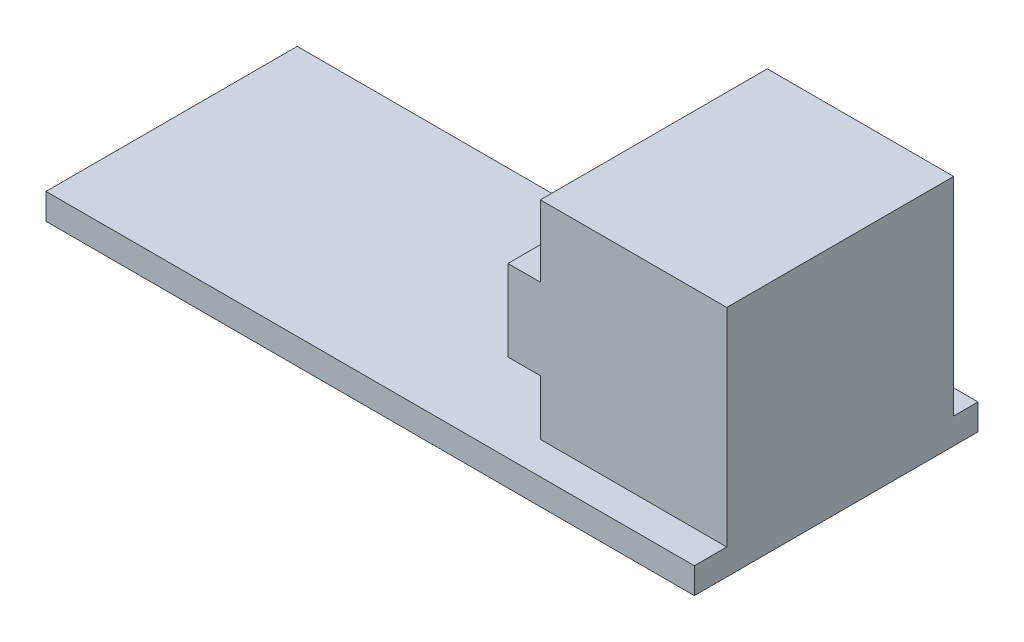
ISO-10303-21;
HEADER;
FILE_DESCRIPTION(('STEP AP214'),'2;1');
FILE_NAME('part.step','',(''),(''),'','','');
FILE_SCHEMA(('AUTOMOTIVE_DESIGN { 1 0 10303 214 1 1 1 1 }'));
ENDSEC;
DATA;
#1=APPLICATION_CONTEXT('core data for automotive mechanical design processes');
#2=APPLICATION_PROTOCOL_DEFINITION('international standard','automotive_design',2000,#1);
#3=PRODUCT_CONTEXT('',#1,'mechanical');
#4=PRODUCT('Part','Part','',(#3));
#5=PRODUCT_RELATED_PRODUCT_CATEGORY('part','',(#4));
#6=PRODUCT_DEFINITION_FORMATION('','',#4);
#7=PRODUCT_DEFINITION_CONTEXT('part definition',#1,'design');
#8=PRODUCT_DEFINITION('design','',#6,#7);
#9=PRODUCT_DEFINITION_SHAPE('','',#8);
#10=(LENGTH_UNIT() NAMED_UNIT(*) SI_UNIT(.MILLI.,.METRE.));
#11=(NAMED_UNIT(*) PLANE_ANGLE_UNIT() SI_UNIT($,.RADIAN.));
#12=(NAMED_UNIT(*) SI_UNIT($,.STERADIAN.) SOLID_ANGLE_UNIT());
#13=UNCERTAINTY_MEASURE_WITH_UNIT(LENGTH_MEASURE(1.E-05),#10,'distance_accuracy_value','');
#14=(GEOMETRIC_REPRESENTATION_CONTEXT(3) GLOBAL_UNCERTAINTY_ASSIGNED_CONTEXT((#13)) GLOBAL_UNIT_ASSIGNED_CONTEXT((#10,
#11,#12)) REPRESENTATION_CONTEXT('',''));
#15=CARTESIAN_POINT('',(0.,0.,0.));
#16=DIRECTION('',(0.,0.,1.));
#17=DIRECTION('',(1.,0.,0.));
#18=AXIS2_PLACEMENT_3D('',#15,#16,#17);
#19=CARTESIAN_POINT('',(0.,1.6,0.));
#20=DIRECTION('',(0.,-1.,0.));
#21=DIRECTION('',(0.,0.,-1.));
#22=AXIS2_PLACEMENT_3D('',#19,#20,#21);
#23=PLANE('',#22);
#24=DIRECTION('',(-1.,0.,0.));
#25=VECTOR('',#24,1.);
#26=CARTESIAN_POINT('',(40.,1.6,-16.));
#27=LINE('',#26,#25);
#28=CARTESIAN_POINT('',(40.,1.6,-16.));
#29=VERTEX_POINT('',#28);
#30=CARTESIAN_POINT('',(28.5,1.6,-16.));
#31=VERTEX_POINT('',#30);
#32=EDGE_CURVE('E54',#29,#31,#27,.T.);
#33=ORIENTED_EDGE('',*,*,#32,.F.);
#34=DIRECTION('',(0.,0.,-1.));
#35=VECTOR('',#34,1.);
#36=CARTESIAN_POINT('',(40.,1.6,-17.5));
#37=LINE('',#36,#35);
#38=CARTESIAN_POINT('',(40.,1.6,-17.5));
#39=VERTEX_POINT('',#38);
#40=EDGE_CURVE('E164',#29,#39,#37,.T.);
#41=ORIENTED_EDGE('',*,*,#40,.T.);
#42=DIRECTION('',(-1.,0.,0.));
#43=VECTOR('',#42,1.);
#44=CARTESIAN_POINT('',(26.,1.6,-17.5));
#45=LINE('',#44,#43);
#46=CARTESIAN_POINT('',(26.,1.6,-17.5));
#47=VERTEX_POINT('',#46);
#48=EDGE_CURVE('E115',#39,#47,#45,.T.);
#49=ORIENTED_EDGE('',*,*,#48,.T.);
#50=DIRECTION('',(0.,0.,1.));
#51=VECTOR('',#50,1.);
#52=CARTESIAN_POINT('',(26.,1.6,-15.5));
#53=LINE('',#52,#51);
#54=CARTESIAN_POINT('',(26.,1.6,-15.5));
#55=VERTEX_POINT('',#54);
#56=EDGE_CURVE('E109',#47,#55,#53,.T.);
#57=ORIENTED_EDGE('',*,*,#56,.T.);
#58=DIRECTION('',(-1.,0.,0.));
#59=VECTOR('',#58,1.);
#60=CARTESIAN_POINT('',(0.,1.6,-15.5));
#61=LINE('',#60,#59);
#62=CARTESIAN_POINT('',(0.,1.6,-15.5));
#63=VERTEX_POINT('',#62);
#64=EDGE_CURVE('E112',#55,#63,#61,.T.);
#65=ORIENTED_EDGE('',*,*,#64,.T.);
#66=DIRECTION('',(0.,0.,1.));
#67=VECTOR('',#66,1.);
#68=CARTESIAN_POINT('',(0.,1.6,0.));
#69=LINE('',#68,#67);
#70=CARTESIAN_POINT('',(0.,1.6,0.));
#71=VERTEX_POINT('',#70);
#72=EDGE_CURVE('E63',#63,#71,#69,.T.);
#73=ORIENTED_EDGE('',*,*,#72,.T.);
#74=DIRECTION('',(1.,0.,0.));
#75=VECTOR('',#74,1.);
#76=CARTESIAN_POINT('',(40.,1.6,0.));
#77=LINE('',#76,#75);
#78=CARTESIAN_POINT('',(40.,1.6,0.));
#79=VERTEX_POINT('',#78);
#80=EDGE_CURVE('E148',#71,#79,#77,.T.);
#81=ORIENTED_EDGE('',*,*,#80,.T.);
#82=CARTESIAN_POINT('',(40.,1.6,-2.));
#83=VERTEX_POINT('',#82);
#84=EDGE_CURVE('E98',#79,#83,#37,.T.);
#85=ORIENTED_EDGE('',*,*,#84,.T.);
#86=DIRECTION('',(-1.,0.,0.));
#87=VECTOR('',#86,1.);
#88=CARTESIAN_POINT('',(40.,1.6,-2.));
#89=LINE('',#88,#87);
#90=CARTESIAN_POINT('',(28.5,1.6,-2.));
#91=VERTEX_POINT('',#90);
#92=EDGE_CURVE('E175',#83,#91,#89,.T.);
#93=ORIENTED_EDGE('',*,*,#92,.T.);
#94=DIRECTION('',(0.,0.,-1.));
#95=VECTOR('',#94,1.);
#96=CARTESIAN_POINT('',(28.5,1.6,-2.));
#97=LINE('',#96,#95);
#98=EDGE_CURVE('E168',#91,#31,#97,.T.);
#99=ORIENTED_EDGE('',*,*,#98,.T.);
#100=EDGE_LOOP('',(#33,#41,#49,#57,#65,#73,#81,#85,#93,#99));
#101=FACE_BOUND('',#100,.T.);
#102=ADVANCED_FACE('F39',(#101),#23,.F.);
#103=CARTESIAN_POINT('',(40.,1.6,0.));
#104=DIRECTION('',(0.,0.,-1.));
#105=DIRECTION('',(-1.,0.,0.));
#106=AXIS2_PLACEMENT_3D('',#103,#104,#105);
#107=PLANE('',#106);
#108=DIRECTION('',(1.,0.,0.));
#109=VECTOR('',#108,1.);
#110=CARTESIAN_POINT('',(40.,0.,0.));
#111=LINE('',#110,#109);
#112=CARTESIAN_POINT('',(0.,0.,0.));
#113=VERTEX_POINT('',#112);
#114=CARTESIAN_POINT('',(40.,0.,0.));
#115=VERTEX_POINT('',#114);
#116=EDGE_CURVE('E136',#113,#115,#111,.T.);
#117=ORIENTED_EDGE('',*,*,#116,.T.);
#118=DIRECTION('',(0.,-1.,0.));
#119=VECTOR('',#118,1.);
#120=CARTESIAN_POINT('',(40.,1.6,0.));
#121=LINE('',#120,#119);
#122=EDGE_CURVE('E11',#79,#115,#121,.T.);
#123=ORIENTED_EDGE('',*,*,#122,.F.);
#124=ORIENTED_EDGE('',*,*,#80,.F.);
#125=DIRECTION('',(0.,-1.,0.));
#126=VECTOR('',#125,1.);
#127=CARTESIAN_POINT('',(0.,1.6,0.));
#128=LINE('',#127,#126);
#129=EDGE_CURVE('E132',#71,#113,#128,.T.);
#130=ORIENTED_EDGE('',*,*,#129,.T.);
#131=EDGE_LOOP('',(#117,#123,#124,#130));
#132=FACE_BOUND('',#131,.T.);
#133=ADVANCED_FACE('F41',(#132),#107,.F.);
#134=CARTESIAN_POINT('',(40.,1.6,-17.5));
#135=DIRECTION('',(-1.,0.,0.));
#136=DIRECTION('',(0.,0.,1.));
#137=AXIS2_PLACEMENT_3D('',#134,#135,#136);
#138=PLANE('',#137);
#139=DIRECTION('',(0.,0.,-1.));
#140=VECTOR('',#139,1.);
#141=CARTESIAN_POINT('',(40.,0.,-17.5));
#142=LINE('',#141,#140);
#143=CARTESIAN_POINT('',(40.,0.,-17.5));
#144=VERTEX_POINT('',#143);
#145=EDGE_CURVE('E139',#115,#144,#142,.T.);
#146=ORIENTED_EDGE('',*,*,#145,.T.);
#147=DIRECTION('',(0.,-1.,0.));
#148=VECTOR('',#147,1.);
#149=CARTESIAN_POINT('',(40.,1.6,-17.5));
#150=LINE('',#149,#148);
#151=EDGE_CURVE('E47',#39,#144,#150,.T.);
#152=ORIENTED_EDGE('',*,*,#151,.F.);
#153=ORIENTED_EDGE('',*,*,#40,.F.);
#154=DIRECTION('',(0.,-1.,0.));
#155=VECTOR('',#154,1.);
#156=CARTESIAN_POINT('',(40.,14.4,-16.));
#157=LINE('',#156,#155);
#158=CARTESIAN_POINT('',(40.,14.4,-16.));
#159=VERTEX_POINT('',#158);
#160=EDGE_CURVE('E261',#159,#29,#157,.T.);
#161=ORIENTED_EDGE('',*,*,#160,.F.);
#162=DIRECTION('',(0.,0.,-1.));
#163=VECTOR('',#162,1.);
#164=CARTESIAN_POINT('',(40.,14.4,-2.));
#165=LINE('',#164,#163);
#166=CARTESIAN_POINT('',(40.,14.4,-2.));
#167=VERTEX_POINT('',#166);
#168=EDGE_CURVE('E140',#167,#159,#165,.T.);
#169=ORIENTED_EDGE('',*,*,#168,.F.);
#170=DIRECTION('',(0.,-1.,0.));
#171=VECTOR('',#170,1.);
#172=CARTESIAN_POINT('',(40.,14.4,-2.));
#173=LINE('',#172,#171);
#174=EDGE_CURVE('E241',#167,#83,#173,.T.);
#175=ORIENTED_EDGE('',*,*,#174,.T.);
#176=ORIENTED_EDGE('',*,*,#84,.F.);
#177=ORIENTED_EDGE('',*,*,#122,.T.);
#178=EDGE_LOOP('',(#146,#152,#153,#161,#169,#175,#176,#177));
#179=FACE_BOUND('',#178,.T.);
#180=ADVANCED_FACE('F281',(#179),#138,.F.);
#181=CARTESIAN_POINT('',(26.,1.6,-17.5));
#182=DIRECTION('',(0.,0.,1.));
#183=DIRECTION('',(1.,0.,0.));
#184=AXIS2_PLACEMENT_3D('',#181,#182,#183);
#185=PLANE('',#184);
#186=DIRECTION('',(-1.,0.,0.));
#187=VECTOR('',#186,1.);
#188=CARTESIAN_POINT('',(26.,0.,-17.5));
#189=LINE('',#188,#187);
#190=CARTESIAN_POINT('',(26.,0.,-17.5));
#191=VERTEX_POINT('',#190);
#192=EDGE_CURVE('E142',#144,#191,#189,.T.);
#193=ORIENTED_EDGE('',*,*,#192,.T.);
#194=DIRECTION('',(0.,-1.,0.));
#195=VECTOR('',#194,1.);
#196=CARTESIAN_POINT('',(26.,1.6,-17.5));
#197=LINE('',#196,#195);
#198=EDGE_CURVE('E127',#47,#191,#197,.T.);
#199=ORIENTED_EDGE('',*,*,#198,.F.);
#200=ORIENTED_EDGE('',*,*,#48,.F.);
#201=ORIENTED_EDGE('',*,*,#151,.T.);
#202=EDGE_LOOP('',(#193,#199,#200,#201));
#203=FACE_BOUND('',#202,.T.);
#204=ADVANCED_FACE('F155',(#203),#185,.F.);
#205=CARTESIAN_POINT('',(26.,1.6,-15.5));
#206=DIRECTION('',(1.,0.,0.));
#207=DIRECTION('',(0.,0.,-1.));
#208=AXIS2_PLACEMENT_3D('',#205,#206,#207);
#209=PLANE('',#208);
#210=DIRECTION('',(0.,0.,1.));
#211=VECTOR('',#210,1.);
#212=CARTESIAN_POINT('',(26.,0.,-15.5));
#213=LINE('',#212,#211);
#214=CARTESIAN_POINT('',(26.,0.,-15.5));
#215=VERTEX_POINT('',#214);
#216=EDGE_CURVE('E124',#191,#215,#213,.T.);
#217=ORIENTED_EDGE('',*,*,#216,.T.);
#218=DIRECTION('',(0.,-1.,0.));
#219=VECTOR('',#218,1.);
#220=CARTESIAN_POINT('',(26.,1.6,-15.5));
#221=LINE('',#220,#219);
#222=EDGE_CURVE('E121',#55,#215,#221,.T.);
#223=ORIENTED_EDGE('',*,*,#222,.F.);
#224=ORIENTED_EDGE('',*,*,#56,.F.);
#225=ORIENTED_EDGE('',*,*,#198,.T.);
#226=EDGE_LOOP('',(#217,#223,#224,#225));
#227=FACE_BOUND('',#226,.T.);
#228=ADVANCED_FACE('F122',(#227),#209,.F.);
#229=CARTESIAN_POINT('',(0.,1.6,-15.5));
#230=DIRECTION('',(0.,0.,1.));
#231=DIRECTION('',(1.,0.,0.));
#232=AXIS2_PLACEMENT_3D('',#229,#230,#231);
#233=PLANE('',#232);
#234=DIRECTION('',(-1.,0.,0.));
#235=VECTOR('',#234,1.);
#236=CARTESIAN_POINT('',(0.,0.,-15.5));
#237=LINE('',#236,#235);
#238=CARTESIAN_POINT('',(0.,0.,-15.5));
#239=VERTEX_POINT('',#238);
#240=EDGE_CURVE('E145',#215,#239,#237,.T.);
#241=ORIENTED_EDGE('',*,*,#240,.T.);
#242=DIRECTION('',(0.,-1.,0.));
#243=VECTOR('',#242,1.);
#244=CARTESIAN_POINT('',(0.,1.6,-15.5));
#245=LINE('',#244,#243);
#246=EDGE_CURVE('E128',#63,#239,#245,.T.);
#247=ORIENTED_EDGE('',*,*,#246,.F.);
#248=ORIENTED_EDGE('',*,*,#64,.F.);
#249=ORIENTED_EDGE('',*,*,#222,.T.);
#250=EDGE_LOOP('',(#241,#247,#248,#249));
#251=FACE_BOUND('',#250,.T.);
#252=ADVANCED_FACE('F130',(#251),#233,.F.);
#253=CARTESIAN_POINT('',(0.,1.6,0.));
#254=DIRECTION('',(1.,0.,0.));
#255=DIRECTION('',(0.,0.,-1.));
#256=AXIS2_PLACEMENT_3D('',#253,#254,#255);
#257=PLANE('',#256);
#258=DIRECTION('',(0.,0.,1.));
#259=VECTOR('',#258,1.);
#260=CARTESIAN_POINT('',(0.,0.,0.));
#261=LINE('',#260,#259);
#262=EDGE_CURVE('E90',#239,#113,#261,.T.);
#263=ORIENTED_EDGE('',*,*,#262,.T.);
#264=ORIENTED_EDGE('',*,*,#129,.F.);
#265=ORIENTED_EDGE('',*,*,#72,.F.);
#266=ORIENTED_EDGE('',*,*,#246,.T.);
#267=EDGE_LOOP('',(#263,#264,#265,#266));
#268=FACE_BOUND('',#267,.T.);
#269=ADVANCED_FACE('F160',(#268),#257,.F.);
#270=CARTESIAN_POINT('',(0.,0.,0.));
#271=DIRECTION('',(0.,-1.,0.));
#272=DIRECTION('',(0.,0.,-1.));
#273=AXIS2_PLACEMENT_3D('',#270,#271,#272);
#274=PLANE('',#273);
#275=ORIENTED_EDGE('',*,*,#116,.F.);
#276=ORIENTED_EDGE('',*,*,#262,.F.);
#277=ORIENTED_EDGE('',*,*,#240,.F.);
#278=ORIENTED_EDGE('',*,*,#216,.F.);
#279=ORIENTED_EDGE('',*,*,#192,.F.);
#280=ORIENTED_EDGE('',*,*,#145,.F.);
#281=EDGE_LOOP('',(#275,#276,#277,#278,#279,#280));
#282=FACE_BOUND('',#281,.T.);
#283=ADVANCED_FACE('F159',(#282),#274,.T.);
#284=CARTESIAN_POINT('',(28.5,14.4,-2.));
#285=DIRECTION('',(0.,1.,0.));
#286=DIRECTION('',(-1.,0.,0.));
#287=AXIS2_PLACEMENT_3D('',#284,#285,#286);
#288=PLANE('',#287);
#289=DIRECTION('',(1.,0.,0.));
#290=VECTOR('',#289,1.);
#291=CARTESIAN_POINT('',(28.5,14.4,-16.));
#292=LINE('',#291,#290);
#293=CARTESIAN_POINT('',(28.5,14.4,-16.));
#294=VERTEX_POINT('',#293);
#295=EDGE_CURVE('E234',#294,#159,#292,.T.);
#296=ORIENTED_EDGE('',*,*,#295,.F.);
#297=DIRECTION('',(0.,0.,-1.));
#298=VECTOR('',#297,1.);
#299=CARTESIAN_POINT('',(28.5,14.4,-2.));
#300=LINE('',#299,#298);
#301=CARTESIAN_POINT('',(28.5,14.4,-2.));
#302=VERTEX_POINT('',#301);
#303=EDGE_CURVE('E219',#302,#294,#300,.T.);
#304=ORIENTED_EDGE('',*,*,#303,.F.);
#305=DIRECTION('',(1.,0.,0.));
#306=VECTOR('',#305,1.);
#307=CARTESIAN_POINT('',(28.5,14.4,-2.));
#308=LINE('',#307,#306);
#309=EDGE_CURVE('E255',#302,#167,#308,.T.);
#310=ORIENTED_EDGE('',*,*,#309,.T.);
#311=ORIENTED_EDGE('',*,*,#168,.T.);
#312=EDGE_LOOP('',(#296,#304,#310,#311));
#313=FACE_BOUND('',#312,.T.);
#314=ADVANCED_FACE('F239',(#313),#288,.T.);
#315=CARTESIAN_POINT('',(28.5,10.,-2.));
#316=DIRECTION('',(-1.,0.,0.));
#317=DIRECTION('',(0.,0.,1.));
#318=AXIS2_PLACEMENT_3D('',#315,#316,#317);
#319=PLANE('',#318);
#320=DIRECTION('',(0.,1.,0.));
#321=VECTOR('',#320,1.);
#322=CARTESIAN_POINT('',(28.5,10.,-16.));
#323=LINE('',#322,#321);
#324=CARTESIAN_POINT('',(28.5,10.,-16.));
#325=VERTEX_POINT('',#324);
#326=EDGE_CURVE('E222',#325,#294,#323,.T.);
#327=ORIENTED_EDGE('',*,*,#326,.F.);
#328=DIRECTION('',(0.,0.,-1.));
#329=VECTOR('',#328,1.);
#330=CARTESIAN_POINT('',(28.5,10.,-2.));
#331=LINE('',#330,#329);
#332=CARTESIAN_POINT('',(28.5,10.,-2.));
#333=VERTEX_POINT('',#332);
#334=EDGE_CURVE('E230',#333,#325,#331,.T.);
#335=ORIENTED_EDGE('',*,*,#334,.F.);
#336=DIRECTION('',(0.,1.,0.));
#337=VECTOR('',#336,1.);
#338=CARTESIAN_POINT('',(28.5,10.,-2.));
#339=LINE('',#338,#337);
#340=EDGE_CURVE('E225',#333,#302,#339,.T.);
#341=ORIENTED_EDGE('',*,*,#340,.T.);
#342=ORIENTED_EDGE('',*,*,#303,.T.);
#343=EDGE_LOOP('',(#327,#335,#341,#342));
#344=FACE_BOUND('',#343,.T.);
#345=ADVANCED_FACE('F221',(#344),#319,.T.);
#346=CARTESIAN_POINT('',(26.5,10.,-2.));
#347=DIRECTION('',(0.,1.,0.));
#348=DIRECTION('',(0.,0.,1.));
#349=AXIS2_PLACEMENT_3D('',#346,#347,#348);
#350=PLANE('',#349);
#351=DIRECTION('',(1.,0.,0.));
#352=VECTOR('',#351,1.);
#353=CARTESIAN_POINT('',(26.5,10.,-16.));
#354=LINE('',#353,#352);
#355=CARTESIAN_POINT('',(26.5,10.,-16.));
#356=VERTEX_POINT('',#355);
#357=EDGE_CURVE('E237',#356,#325,#354,.T.);
#358=ORIENTED_EDGE('',*,*,#357,.F.);
#359=DIRECTION('',(0.,0.,-1.));
#360=VECTOR('',#359,1.);
#361=CARTESIAN_POINT('',(26.5,10.,-2.));
#362=LINE('',#361,#360);
#363=CARTESIAN_POINT('',(26.5,10.,-2.));
#364=VERTEX_POINT('',#363);
#365=EDGE_CURVE('E248',#364,#356,#362,.T.);
#366=ORIENTED_EDGE('',*,*,#365,.F.);
#367=DIRECTION('',(1.,0.,0.));
#368=VECTOR('',#367,1.);
#369=CARTESIAN_POINT('',(26.5,10.,-2.));
#370=LINE('',#369,#368);
#371=EDGE_CURVE('E257',#364,#333,#370,.T.);
#372=ORIENTED_EDGE('',*,*,#371,.T.);
#373=ORIENTED_EDGE('',*,*,#334,.T.);
#374=EDGE_LOOP('',(#358,#366,#372,#373));
#375=FACE_BOUND('',#374,.T.);
#376=ADVANCED_FACE('F279',(#375),#350,.T.);
#377=CARTESIAN_POINT('',(26.5,5.,-2.));
#378=DIRECTION('',(-1.,0.,0.));
#379=DIRECTION('',(0.,0.,1.));
#380=AXIS2_PLACEMENT_3D('',#377,#378,#379);
#381=PLANE('',#380);
#382=DIRECTION('',(0.,1.,0.));
#383=VECTOR('',#382,1.);
#384=CARTESIAN_POINT('',(26.5,5.,-16.));
#385=LINE('',#384,#383);
#386=CARTESIAN_POINT('',(26.5,5.,-16.));
#387=VERTEX_POINT('',#386);
#388=EDGE_CURVE('E269',#387,#356,#385,.T.);
#389=ORIENTED_EDGE('',*,*,#388,.F.);
#390=DIRECTION('',(0.,0.,-1.));
#391=VECTOR('',#390,1.);
#392=CARTESIAN_POINT('',(26.5,5.,-2.));
#393=LINE('',#392,#391);
#394=CARTESIAN_POINT('',(26.5,5.,-2.));
#395=VERTEX_POINT('',#394);
#396=EDGE_CURVE('E250',#395,#387,#393,.T.);
#397=ORIENTED_EDGE('',*,*,#396,.F.);
#398=DIRECTION('',(0.,1.,0.));
#399=VECTOR('',#398,1.);
#400=CARTESIAN_POINT('',(26.5,5.,-2.));
#401=LINE('',#400,#399);
#402=EDGE_CURVE('E275',#395,#364,#401,.T.);
#403=ORIENTED_EDGE('',*,*,#402,.T.);
#404=ORIENTED_EDGE('',*,*,#365,.T.);
#405=EDGE_LOOP('',(#389,#397,#403,#404));
#406=FACE_BOUND('',#405,.T.);
#407=ADVANCED_FACE('F272',(#406),#381,.T.);
#408=CARTESIAN_POINT('',(28.5,5.,-2.));
#409=DIRECTION('',(0.,-1.,0.));
#410=DIRECTION('',(0.,0.,-1.));
#411=AXIS2_PLACEMENT_3D('',#408,#409,#410);
#412=PLANE('',#411);
#413=DIRECTION('',(-1.,0.,0.));
#414=VECTOR('',#413,1.);
#415=CARTESIAN_POINT('',(28.5,5.,-16.));
#416=LINE('',#415,#414);
#417=CARTESIAN_POINT('',(28.5,5.,-16.));
#418=VERTEX_POINT('',#417);
#419=EDGE_CURVE('E266',#418,#387,#416,.T.);
#420=ORIENTED_EDGE('',*,*,#419,.F.);
#421=DIRECTION('',(0.,0.,-1.));
#422=VECTOR('',#421,1.);
#423=CARTESIAN_POINT('',(28.5,5.,-2.));
#424=LINE('',#423,#422);
#425=CARTESIAN_POINT('',(28.5,5.,-2.));
#426=VERTEX_POINT('',#425);
#427=EDGE_CURVE('E251',#426,#418,#424,.T.);
#428=ORIENTED_EDGE('',*,*,#427,.F.);
#429=DIRECTION('',(-1.,0.,0.));
#430=VECTOR('',#429,1.);
#431=CARTESIAN_POINT('',(28.5,5.,-2.));
#432=LINE('',#431,#430);
#433=EDGE_CURVE('E450',#426,#395,#432,.T.);
#434=ORIENTED_EDGE('',*,*,#433,.T.);
#435=ORIENTED_EDGE('',*,*,#396,.T.);
#436=EDGE_LOOP('',(#420,#428,#434,#435));
#437=FACE_BOUND('',#436,.T.);
#438=ADVANCED_FACE('F344',(#437),#412,.T.);
#439=CARTESIAN_POINT('',(28.5,1.6,-2.));
#440=DIRECTION('',(-1.,0.,0.));
#441=DIRECTION('',(0.,0.,1.));
#442=AXIS2_PLACEMENT_3D('',#439,#440,#441);
#443=PLANE('',#442);
#444=DIRECTION('',(0.,1.,0.));
#445=VECTOR('',#444,1.);
#446=CARTESIAN_POINT('',(28.5,1.6,-16.));
#447=LINE('',#446,#445);
#448=EDGE_CURVE('E264',#31,#418,#447,.T.);
#449=ORIENTED_EDGE('',*,*,#448,.F.);
#450=ORIENTED_EDGE('',*,*,#98,.F.);
#451=DIRECTION('',(0.,1.,0.));
#452=VECTOR('',#451,1.);
#453=CARTESIAN_POINT('',(28.5,1.6,-2.));
#454=LINE('',#453,#452);
#455=EDGE_CURVE('E447',#91,#426,#454,.T.);
#456=ORIENTED_EDGE('',*,*,#455,.T.);
#457=ORIENTED_EDGE('',*,*,#427,.T.);
#458=EDGE_LOOP('',(#449,#450,#456,#457));
#459=FACE_BOUND('',#458,.T.);
#460=ADVANCED_FACE('F294',(#459),#443,.T.);
#461=CARTESIAN_POINT('',(0.,0.,-2.));
#462=DIRECTION('',(0.,0.,-1.));
#463=DIRECTION('',(-1.,0.,0.));
#464=AXIS2_PLACEMENT_3D('',#461,#462,#463);
#465=PLANE('',#464);
#466=ORIENTED_EDGE('',*,*,#174,.F.);
#467=ORIENTED_EDGE('',*,*,#309,.F.);
#468=ORIENTED_EDGE('',*,*,#340,.F.);
#469=ORIENTED_EDGE('',*,*,#371,.F.);
#470=ORIENTED_EDGE('',*,*,#402,.F.);
#471=ORIENTED_EDGE('',*,*,#433,.F.);
#472=ORIENTED_EDGE('',*,*,#455,.F.);
#473=ORIENTED_EDGE('',*,*,#92,.F.);
#474=EDGE_LOOP('',(#466,#467,#468,#469,#470,#471,#472,#473));
#475=FACE_BOUND('',#474,.T.);
#476=ADVANCED_FACE('F280',(#475),#465,.F.);
#477=CARTESIAN_POINT('',(0.,0.,-16.));
#478=DIRECTION('',(0.,0.,-1.));
#479=DIRECTION('',(-1.,0.,0.));
#480=AXIS2_PLACEMENT_3D('',#477,#478,#479);
#481=PLANE('',#480);
#482=ORIENTED_EDGE('',*,*,#160,.T.);
#483=ORIENTED_EDGE('',*,*,#32,.T.);
#484=ORIENTED_EDGE('',*,*,#448,.T.);
#485=ORIENTED_EDGE('',*,*,#419,.T.);
#486=ORIENTED_EDGE('',*,*,#388,.T.);
#487=ORIENTED_EDGE('',*,*,#357,.T.);
#488=ORIENTED_EDGE('',*,*,#326,.T.);
#489=ORIENTED_EDGE('',*,*,#295,.T.);
#490=EDGE_LOOP('',(#482,#483,#484,#485,#486,#487,#488,#489));
#491=FACE_BOUND('',#490,.T.);
#492=ADVANCED_FACE('F233',(#491),#481,.T.);
#493=CLOSED_SHELL('',(#102,#133,#180,#204,#228,#252,#269,#283,#314,#345,#376,#407,#438,#460,
#476,#492));
#494=MANIFOLD_SOLID_BREP('B2',#493);
#495=ADVANCED_BREP_SHAPE_REPRESENTATION('',(#18,#494),#14);
#496=SHAPE_DEFINITION_REPRESENTATION(#9,#495);
ENDSEC;
END-ISO-10303-21;
